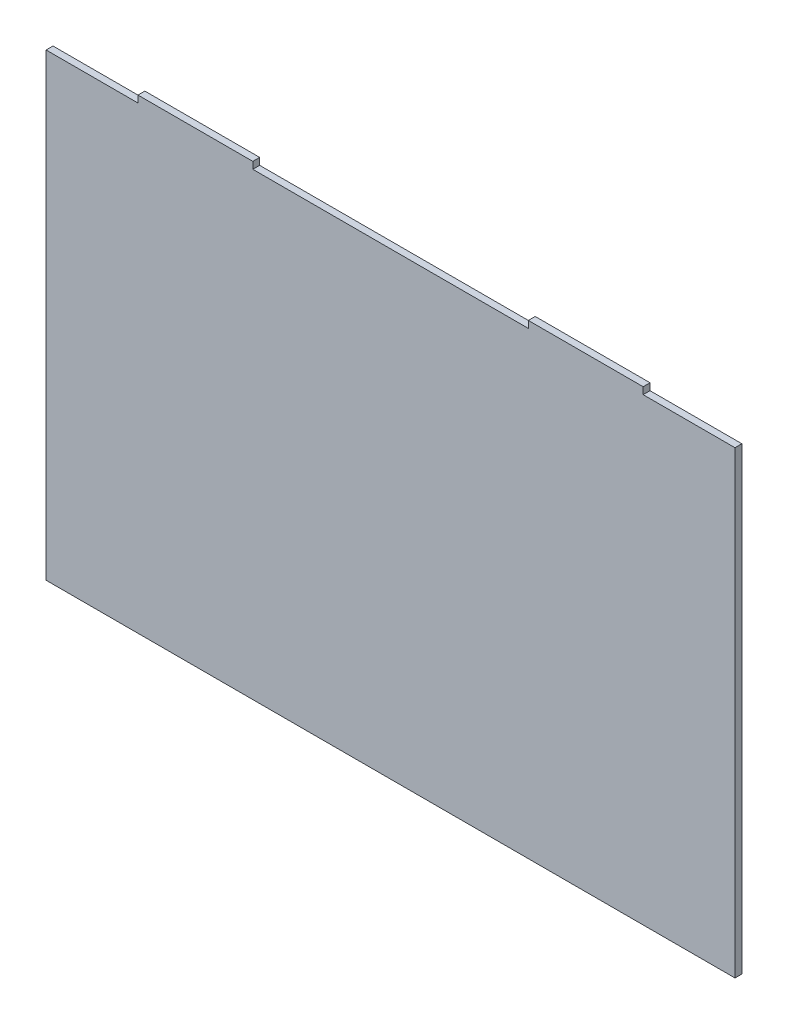
ISO-10303-21;
HEADER;
FILE_DESCRIPTION(('STEP AP214'),'2;1');
FILE_NAME('part.step','',(''),(''),'','','');
FILE_SCHEMA(('AUTOMOTIVE_DESIGN { 1 0 10303 214 1 1 1 1 }'));
ENDSEC;
DATA;
#1=APPLICATION_CONTEXT('core data for automotive mechanical design processes');
#2=APPLICATION_PROTOCOL_DEFINITION('international standard','automotive_design',2000,#1);
#3=PRODUCT_CONTEXT('',#1,'mechanical');
#4=PRODUCT('Part','Part','',(#3));
#5=PRODUCT_RELATED_PRODUCT_CATEGORY('part','',(#4));
#6=PRODUCT_DEFINITION_FORMATION('','',#4);
#7=PRODUCT_DEFINITION_CONTEXT('part definition',#1,'design');
#8=PRODUCT_DEFINITION('design','',#6,#7);
#9=PRODUCT_DEFINITION_SHAPE('','',#8);
#10=(LENGTH_UNIT() NAMED_UNIT(*) SI_UNIT(.MILLI.,.METRE.));
#11=(NAMED_UNIT(*) PLANE_ANGLE_UNIT() SI_UNIT($,.RADIAN.));
#12=(NAMED_UNIT(*) SI_UNIT($,.STERADIAN.) SOLID_ANGLE_UNIT());
#13=UNCERTAINTY_MEASURE_WITH_UNIT(LENGTH_MEASURE(1.E-05),#10,'distance_accuracy_value','');
#14=(GEOMETRIC_REPRESENTATION_CONTEXT(3) GLOBAL_UNCERTAINTY_ASSIGNED_CONTEXT((#13)) GLOBAL_UNIT_ASSIGNED_CONTEXT((#10,
#11,#12)) REPRESENTATION_CONTEXT('',''));
#15=CARTESIAN_POINT('',(0.,0.,0.));
#16=DIRECTION('',(0.,0.,1.));
#17=DIRECTION('',(1.,0.,0.));
#18=AXIS2_PLACEMENT_3D('',#15,#16,#17);
#19=CARTESIAN_POINT('',(150.,101.5,3.));
#20=DIRECTION('',(0.,-1.,0.));
#21=DIRECTION('',(1.,0.,0.));
#22=AXIS2_PLACEMENT_3D('',#19,#20,#21);
#23=PLANE('',#22);
#24=DIRECTION('',(-1.,0.,0.));
#25=VECTOR('',#24,1.);
#26=CARTESIAN_POINT('',(150.,101.5,3.));
#27=LINE('',#26,#25);
#28=CARTESIAN_POINT('',(-59.9999999999999,101.5,3.));
#29=VERTEX_POINT('',#28);
#30=CARTESIAN_POINT('',(-110.,101.5,3.));
#31=VERTEX_POINT('',#30);
#32=EDGE_CURVE('E200',#29,#31,#27,.T.);
#33=ORIENTED_EDGE('',*,*,#32,.F.);
#34=DIRECTION('',(0.,0.,1.));
#35=VECTOR('',#34,1.);
#36=CARTESIAN_POINT('',(-59.9999999999999,101.5,0.));
#37=LINE('',#36,#35);
#38=CARTESIAN_POINT('',(-59.9999999999999,101.5,0.));
#39=VERTEX_POINT('',#38);
#40=EDGE_CURVE('E152',#39,#29,#37,.T.);
#41=ORIENTED_EDGE('',*,*,#40,.F.);
#42=DIRECTION('',(-1.,0.,0.));
#43=VECTOR('',#42,1.);
#44=CARTESIAN_POINT('',(150.,101.5,0.));
#45=LINE('',#44,#43);
#46=CARTESIAN_POINT('',(-110.,101.5,0.));
#47=VERTEX_POINT('',#46);
#48=EDGE_CURVE('E142',#39,#47,#45,.T.);
#49=ORIENTED_EDGE('',*,*,#48,.T.);
#50=DIRECTION('',(0.,0.,1.));
#51=VECTOR('',#50,1.);
#52=CARTESIAN_POINT('',(-110.,101.5,0.));
#53=LINE('',#52,#51);
#54=EDGE_CURVE('E185',#47,#31,#53,.T.);
#55=ORIENTED_EDGE('',*,*,#54,.T.);
#56=EDGE_LOOP('',(#33,#41,#49,#55));
#57=FACE_BOUND('',#56,.T.);
#58=ADVANCED_FACE('F33',(#57),#23,.F.);
#59=CARTESIAN_POINT('',(-150.,-101.5,3.));
#60=DIRECTION('',(1.,0.,0.));
#61=DIRECTION('',(0.,0.,-1.));
#62=AXIS2_PLACEMENT_3D('',#59,#60,#61);
#63=PLANE('',#62);
#64=DIRECTION('',(0.,-1.,0.));
#65=VECTOR('',#64,1.);
#66=CARTESIAN_POINT('',(-150.,-101.5,3.));
#67=LINE('',#66,#65);
#68=CARTESIAN_POINT('',(-150.,98.5,3.));
#69=VERTEX_POINT('',#68);
#70=CARTESIAN_POINT('',(-150.,-101.5,3.));
#71=VERTEX_POINT('',#70);
#72=EDGE_CURVE('E192',#69,#71,#67,.T.);
#73=ORIENTED_EDGE('',*,*,#72,.F.);
#74=DIRECTION('',(0.,0.,1.));
#75=VECTOR('',#74,1.);
#76=CARTESIAN_POINT('',(-150.,98.5,0.));
#77=LINE('',#76,#75);
#78=CARTESIAN_POINT('',(-150.,98.5,0.));
#79=VERTEX_POINT('',#78);
#80=EDGE_CURVE('E180',#79,#69,#77,.T.);
#81=ORIENTED_EDGE('',*,*,#80,.F.);
#82=DIRECTION('',(0.,-1.,0.));
#83=VECTOR('',#82,1.);
#84=CARTESIAN_POINT('',(-150.,-101.5,0.));
#85=LINE('',#84,#83);
#86=CARTESIAN_POINT('',(-150.,-101.5,0.));
#87=VERTEX_POINT('',#86);
#88=EDGE_CURVE('E188',#79,#87,#85,.T.);
#89=ORIENTED_EDGE('',*,*,#88,.T.);
#90=DIRECTION('',(0.,0.,-1.));
#91=VECTOR('',#90,1.);
#92=CARTESIAN_POINT('',(-150.,-101.5,3.));
#93=LINE('',#92,#91);
#94=EDGE_CURVE('E11',#71,#87,#93,.T.);
#95=ORIENTED_EDGE('',*,*,#94,.F.);
#96=EDGE_LOOP('',(#73,#81,#89,#95));
#97=FACE_BOUND('',#96,.T.);
#98=ADVANCED_FACE('F35',(#97),#63,.F.);
#99=CARTESIAN_POINT('',(150.,-101.5,3.));
#100=DIRECTION('',(0.,1.,0.));
#101=DIRECTION('',(-1.,0.,0.));
#102=AXIS2_PLACEMENT_3D('',#99,#100,#101);
#103=PLANE('',#102);
#104=DIRECTION('',(1.,0.,0.));
#105=VECTOR('',#104,1.);
#106=CARTESIAN_POINT('',(150.,-101.5,0.));
#107=LINE('',#106,#105);
#108=CARTESIAN_POINT('',(150.,-101.5,0.));
#109=VERTEX_POINT('',#108);
#110=EDGE_CURVE('E204',#87,#109,#107,.T.);
#111=ORIENTED_EDGE('',*,*,#110,.T.);
#112=DIRECTION('',(0.,0.,-1.));
#113=VECTOR('',#112,1.);
#114=CARTESIAN_POINT('',(150.,-101.5,3.));
#115=LINE('',#114,#113);
#116=CARTESIAN_POINT('',(150.,-101.5,3.));
#117=VERTEX_POINT('',#116);
#118=EDGE_CURVE('E41',#117,#109,#115,.T.);
#119=ORIENTED_EDGE('',*,*,#118,.F.);
#120=DIRECTION('',(1.,0.,0.));
#121=VECTOR('',#120,1.);
#122=CARTESIAN_POINT('',(150.,-101.5,3.));
#123=LINE('',#122,#121);
#124=EDGE_CURVE('E194',#71,#117,#123,.T.);
#125=ORIENTED_EDGE('',*,*,#124,.F.);
#126=ORIENTED_EDGE('',*,*,#94,.T.);
#127=EDGE_LOOP('',(#111,#119,#125,#126));
#128=FACE_BOUND('',#127,.T.);
#129=ADVANCED_FACE('F236',(#128),#103,.F.);
#130=CARTESIAN_POINT('',(150.,-101.5,3.));
#131=DIRECTION('',(-1.,0.,0.));
#132=DIRECTION('',(0.,0.,1.));
#133=AXIS2_PLACEMENT_3D('',#130,#131,#132);
#134=PLANE('',#133);
#135=DIRECTION('',(0.,1.,0.));
#136=VECTOR('',#135,1.);
#137=CARTESIAN_POINT('',(150.,-101.5,0.));
#138=LINE('',#137,#136);
#139=CARTESIAN_POINT('',(150.,98.5,0.));
#140=VERTEX_POINT('',#139);
#141=EDGE_CURVE('E206',#109,#140,#138,.T.);
#142=ORIENTED_EDGE('',*,*,#141,.T.);
#143=DIRECTION('',(0.,0.,1.));
#144=VECTOR('',#143,1.);
#145=CARTESIAN_POINT('',(150.,98.5,0.));
#146=LINE('',#145,#144);
#147=CARTESIAN_POINT('',(150.,98.5,3.));
#148=VERTEX_POINT('',#147);
#149=EDGE_CURVE('E150',#140,#148,#146,.T.);
#150=ORIENTED_EDGE('',*,*,#149,.T.);
#151=DIRECTION('',(0.,1.,0.));
#152=VECTOR('',#151,1.);
#153=CARTESIAN_POINT('',(150.,-101.5,3.));
#154=LINE('',#153,#152);
#155=EDGE_CURVE('E197',#117,#148,#154,.T.);
#156=ORIENTED_EDGE('',*,*,#155,.F.);
#157=ORIENTED_EDGE('',*,*,#118,.T.);
#158=EDGE_LOOP('',(#142,#150,#156,#157));
#159=FACE_BOUND('',#158,.T.);
#160=ADVANCED_FACE('F230',(#159),#134,.F.);
#161=CARTESIAN_POINT('',(110.,101.5,0.));
#162=VERTEX_POINT('',#161);
#163=CARTESIAN_POINT('',(60.,101.5,0.));
#164=VERTEX_POINT('',#163);
#165=EDGE_CURVE('E195',#162,#164,#45,.T.);
#166=ORIENTED_EDGE('',*,*,#165,.T.);
#167=DIRECTION('',(0.,0.,1.));
#168=VECTOR('',#167,1.);
#169=CARTESIAN_POINT('',(60.,101.5,0.));
#170=LINE('',#169,#168);
#171=CARTESIAN_POINT('',(60.,101.5,3.));
#172=VERTEX_POINT('',#171);
#173=EDGE_CURVE('E155',#164,#172,#170,.T.);
#174=ORIENTED_EDGE('',*,*,#173,.T.);
#175=CARTESIAN_POINT('',(110.,101.5,3.));
#176=VERTEX_POINT('',#175);
#177=EDGE_CURVE('E202',#176,#172,#27,.T.);
#178=ORIENTED_EDGE('',*,*,#177,.F.);
#179=DIRECTION('',(0.,0.,1.));
#180=VECTOR('',#179,1.);
#181=CARTESIAN_POINT('',(110.,101.5,0.));
#182=LINE('',#181,#180);
#183=EDGE_CURVE('E164',#162,#176,#182,.T.);
#184=ORIENTED_EDGE('',*,*,#183,.F.);
#185=EDGE_LOOP('',(#166,#174,#178,#184));
#186=FACE_BOUND('',#185,.T.);
#187=ADVANCED_FACE('F224',(#186),#23,.F.);
#188=CARTESIAN_POINT('',(0.,0.,3.));
#189=DIRECTION('',(0.,0.,1.));
#190=DIRECTION('',(1.,0.,0.));
#191=AXIS2_PLACEMENT_3D('',#188,#189,#190);
#192=PLANE('',#191);
#193=DIRECTION('',(0.,-1.,0.));
#194=VECTOR('',#193,1.);
#195=CARTESIAN_POINT('',(-59.9999999999999,101.5,3.));
#196=LINE('',#195,#194);
#197=CARTESIAN_POINT('',(-59.9999999999999,98.5,3.));
#198=VERTEX_POINT('',#197);
#199=EDGE_CURVE('E128',#29,#198,#196,.T.);
#200=ORIENTED_EDGE('',*,*,#199,.F.);
#201=ORIENTED_EDGE('',*,*,#32,.T.);
#202=DIRECTION('',(0.,1.,0.));
#203=VECTOR('',#202,1.);
#204=CARTESIAN_POINT('',(-110.,101.5,3.));
#205=LINE('',#204,#203);
#206=CARTESIAN_POINT('',(-110.,98.5,3.));
#207=VERTEX_POINT('',#206);
#208=EDGE_CURVE('E178',#207,#31,#205,.T.);
#209=ORIENTED_EDGE('',*,*,#208,.F.);
#210=DIRECTION('',(1.,0.,0.));
#211=VECTOR('',#210,1.);
#212=CARTESIAN_POINT('',(-150.,98.5,3.));
#213=LINE('',#212,#211);
#214=EDGE_CURVE('E154',#69,#207,#213,.T.);
#215=ORIENTED_EDGE('',*,*,#214,.F.);
#216=ORIENTED_EDGE('',*,*,#72,.T.);
#217=ORIENTED_EDGE('',*,*,#124,.T.);
#218=ORIENTED_EDGE('',*,*,#155,.T.);
#219=DIRECTION('',(1.,0.,0.));
#220=VECTOR('',#219,1.);
#221=CARTESIAN_POINT('',(150.,98.5,3.));
#222=LINE('',#221,#220);
#223=CARTESIAN_POINT('',(110.,98.5,3.));
#224=VERTEX_POINT('',#223);
#225=EDGE_CURVE('E162',#224,#148,#222,.T.);
#226=ORIENTED_EDGE('',*,*,#225,.F.);
#227=DIRECTION('',(0.,-1.,0.));
#228=VECTOR('',#227,1.);
#229=CARTESIAN_POINT('',(110.,101.5,3.));
#230=LINE('',#229,#228);
#231=EDGE_CURVE('E165',#176,#224,#230,.T.);
#232=ORIENTED_EDGE('',*,*,#231,.F.);
#233=ORIENTED_EDGE('',*,*,#177,.T.);
#234=DIRECTION('',(0.,1.,0.));
#235=VECTOR('',#234,1.);
#236=CARTESIAN_POINT('',(60.,101.5,3.));
#237=LINE('',#236,#235);
#238=CARTESIAN_POINT('',(60.,98.5,3.));
#239=VERTEX_POINT('',#238);
#240=EDGE_CURVE('E143',#239,#172,#237,.T.);
#241=ORIENTED_EDGE('',*,*,#240,.F.);
#242=DIRECTION('',(1.,0.,0.));
#243=VECTOR('',#242,1.);
#244=CARTESIAN_POINT('',(-59.9999999999999,98.5,3.));
#245=LINE('',#244,#243);
#246=EDGE_CURVE('E145',#198,#239,#245,.T.);
#247=ORIENTED_EDGE('',*,*,#246,.F.);
#248=EDGE_LOOP('',(#200,#201,#209,#215,#216,#217,#218,#226,#232,#233,#241,#247));
#249=FACE_BOUND('',#248,.T.);
#250=ADVANCED_FACE('F219',(#249),#192,.T.);
#251=CARTESIAN_POINT('',(0.,0.,0.));
#252=DIRECTION('',(0.,0.,1.));
#253=DIRECTION('',(1.,0.,0.));
#254=AXIS2_PLACEMENT_3D('',#251,#252,#253);
#255=PLANE('',#254);
#256=ORIENTED_EDGE('',*,*,#48,.F.);
#257=DIRECTION('',(0.,-1.,0.));
#258=VECTOR('',#257,1.);
#259=CARTESIAN_POINT('',(-59.9999999999999,101.5,0.));
#260=LINE('',#259,#258);
#261=CARTESIAN_POINT('',(-59.9999999999999,98.5,0.));
#262=VERTEX_POINT('',#261);
#263=EDGE_CURVE('E125',#39,#262,#260,.T.);
#264=ORIENTED_EDGE('',*,*,#263,.T.);
#265=DIRECTION('',(1.,0.,0.));
#266=VECTOR('',#265,1.);
#267=CARTESIAN_POINT('',(-59.9999999999999,98.5,0.));
#268=LINE('',#267,#266);
#269=CARTESIAN_POINT('',(60.,98.5,0.));
#270=VERTEX_POINT('',#269);
#271=EDGE_CURVE('E135',#262,#270,#268,.T.);
#272=ORIENTED_EDGE('',*,*,#271,.T.);
#273=DIRECTION('',(0.,1.,0.));
#274=VECTOR('',#273,1.);
#275=CARTESIAN_POINT('',(60.,101.5,0.));
#276=LINE('',#275,#274);
#277=EDGE_CURVE('E48',#270,#164,#276,.T.);
#278=ORIENTED_EDGE('',*,*,#277,.T.);
#279=ORIENTED_EDGE('',*,*,#165,.F.);
#280=DIRECTION('',(0.,-1.,0.));
#281=VECTOR('',#280,1.);
#282=CARTESIAN_POINT('',(110.,101.5,0.));
#283=LINE('',#282,#281);
#284=CARTESIAN_POINT('',(110.,98.5,0.));
#285=VERTEX_POINT('',#284);
#286=EDGE_CURVE('E159',#162,#285,#283,.T.);
#287=ORIENTED_EDGE('',*,*,#286,.T.);
#288=DIRECTION('',(1.,0.,0.));
#289=VECTOR('',#288,1.);
#290=CARTESIAN_POINT('',(150.,98.5,0.));
#291=LINE('',#290,#289);
#292=EDGE_CURVE('E56',#285,#140,#291,.T.);
#293=ORIENTED_EDGE('',*,*,#292,.T.);
#294=ORIENTED_EDGE('',*,*,#141,.F.);
#295=ORIENTED_EDGE('',*,*,#110,.F.);
#296=ORIENTED_EDGE('',*,*,#88,.F.);
#297=DIRECTION('',(1.,0.,0.));
#298=VECTOR('',#297,1.);
#299=CARTESIAN_POINT('',(-150.,98.5,0.));
#300=LINE('',#299,#298);
#301=CARTESIAN_POINT('',(-110.,98.5,0.));
#302=VERTEX_POINT('',#301);
#303=EDGE_CURVE('E174',#79,#302,#300,.T.);
#304=ORIENTED_EDGE('',*,*,#303,.T.);
#305=DIRECTION('',(0.,1.,0.));
#306=VECTOR('',#305,1.);
#307=CARTESIAN_POINT('',(-110.,101.5,0.));
#308=LINE('',#307,#306);
#309=EDGE_CURVE('E177',#302,#47,#308,.T.);
#310=ORIENTED_EDGE('',*,*,#309,.T.);
#311=EDGE_LOOP('',(#256,#264,#272,#278,#279,#287,#293,#294,#295,#296,#304,#310));
#312=FACE_BOUND('',#311,.T.);
#313=ADVANCED_FACE('F140',(#312),#255,.F.);
#314=CARTESIAN_POINT('',(-110.,101.5,0.));
#315=DIRECTION('',(1.,0.,0.));
#316=DIRECTION('',(0.,0.,-1.));
#317=AXIS2_PLACEMENT_3D('',#314,#315,#316);
#318=PLANE('',#317);
#319=ORIENTED_EDGE('',*,*,#208,.T.);
#320=ORIENTED_EDGE('',*,*,#54,.F.);
#321=ORIENTED_EDGE('',*,*,#309,.F.);
#322=DIRECTION('',(0.,0.,1.));
#323=VECTOR('',#322,1.);
#324=CARTESIAN_POINT('',(-110.,98.5,0.));
#325=LINE('',#324,#323);
#326=EDGE_CURVE('E189',#302,#207,#325,.T.);
#327=ORIENTED_EDGE('',*,*,#326,.T.);
#328=EDGE_LOOP('',(#319,#320,#321,#327));
#329=FACE_BOUND('',#328,.T.);
#330=ADVANCED_FACE('F248',(#329),#318,.F.);
#331=CARTESIAN_POINT('',(-150.,98.5,0.));
#332=DIRECTION('',(0.,-1.,0.));
#333=DIRECTION('',(0.,0.,-1.));
#334=AXIS2_PLACEMENT_3D('',#331,#332,#333);
#335=PLANE('',#334);
#336=ORIENTED_EDGE('',*,*,#214,.T.);
#337=ORIENTED_EDGE('',*,*,#326,.F.);
#338=ORIENTED_EDGE('',*,*,#303,.F.);
#339=ORIENTED_EDGE('',*,*,#80,.T.);
#340=EDGE_LOOP('',(#336,#337,#338,#339));
#341=FACE_BOUND('',#340,.T.);
#342=ADVANCED_FACE('F242',(#341),#335,.F.);
#343=CARTESIAN_POINT('',(150.,98.5,0.));
#344=DIRECTION('',(0.,-1.,0.));
#345=DIRECTION('',(0.,0.,-1.));
#346=AXIS2_PLACEMENT_3D('',#343,#344,#345);
#347=PLANE('',#346);
#348=ORIENTED_EDGE('',*,*,#225,.T.);
#349=ORIENTED_EDGE('',*,*,#149,.F.);
#350=ORIENTED_EDGE('',*,*,#292,.F.);
#351=DIRECTION('',(0.,0.,1.));
#352=VECTOR('',#351,1.);
#353=CARTESIAN_POINT('',(110.,98.5,0.));
#354=LINE('',#353,#352);
#355=EDGE_CURVE('E171',#285,#224,#354,.T.);
#356=ORIENTED_EDGE('',*,*,#355,.T.);
#357=EDGE_LOOP('',(#348,#349,#350,#356));
#358=FACE_BOUND('',#357,.T.);
#359=ADVANCED_FACE('F229',(#358),#347,.F.);
#360=CARTESIAN_POINT('',(110.,101.5,0.));
#361=DIRECTION('',(-1.,0.,0.));
#362=DIRECTION('',(0.,0.,1.));
#363=AXIS2_PLACEMENT_3D('',#360,#361,#362);
#364=PLANE('',#363);
#365=ORIENTED_EDGE('',*,*,#231,.T.);
#366=ORIENTED_EDGE('',*,*,#355,.F.);
#367=ORIENTED_EDGE('',*,*,#286,.F.);
#368=ORIENTED_EDGE('',*,*,#183,.T.);
#369=EDGE_LOOP('',(#365,#366,#367,#368));
#370=FACE_BOUND('',#369,.T.);
#371=ADVANCED_FACE('F228',(#370),#364,.F.);
#372=CARTESIAN_POINT('',(-59.9999999999999,101.5,0.));
#373=DIRECTION('',(-1.,0.,0.));
#374=DIRECTION('',(0.,0.,1.));
#375=AXIS2_PLACEMENT_3D('',#372,#373,#374);
#376=PLANE('',#375);
#377=ORIENTED_EDGE('',*,*,#199,.T.);
#378=DIRECTION('',(0.,0.,1.));
#379=VECTOR('',#378,1.);
#380=CARTESIAN_POINT('',(-59.9999999999999,98.5,0.));
#381=LINE('',#380,#379);
#382=EDGE_CURVE('E121',#262,#198,#381,.T.);
#383=ORIENTED_EDGE('',*,*,#382,.F.);
#384=ORIENTED_EDGE('',*,*,#263,.F.);
#385=ORIENTED_EDGE('',*,*,#40,.T.);
#386=EDGE_LOOP('',(#377,#383,#384,#385));
#387=FACE_BOUND('',#386,.T.);
#388=ADVANCED_FACE('F123',(#387),#376,.F.);
#389=CARTESIAN_POINT('',(60.,101.5,0.));
#390=DIRECTION('',(1.,0.,0.));
#391=DIRECTION('',(0.,0.,-1.));
#392=AXIS2_PLACEMENT_3D('',#389,#390,#391);
#393=PLANE('',#392);
#394=ORIENTED_EDGE('',*,*,#240,.T.);
#395=ORIENTED_EDGE('',*,*,#173,.F.);
#396=ORIENTED_EDGE('',*,*,#277,.F.);
#397=DIRECTION('',(0.,0.,1.));
#398=VECTOR('',#397,1.);
#399=CARTESIAN_POINT('',(60.,98.5,0.));
#400=LINE('',#399,#398);
#401=EDGE_CURVE('E132',#270,#239,#400,.T.);
#402=ORIENTED_EDGE('',*,*,#401,.T.);
#403=EDGE_LOOP('',(#394,#395,#396,#402));
#404=FACE_BOUND('',#403,.T.);
#405=ADVANCED_FACE('F226',(#404),#393,.F.);
#406=CARTESIAN_POINT('',(-59.9999999999999,98.5,0.));
#407=DIRECTION('',(0.,-1.,0.));
#408=DIRECTION('',(0.,0.,-1.));
#409=AXIS2_PLACEMENT_3D('',#406,#407,#408);
#410=PLANE('',#409);
#411=ORIENTED_EDGE('',*,*,#246,.T.);
#412=ORIENTED_EDGE('',*,*,#401,.F.);
#413=ORIENTED_EDGE('',*,*,#271,.F.);
#414=ORIENTED_EDGE('',*,*,#382,.T.);
#415=EDGE_LOOP('',(#411,#412,#413,#414));
#416=FACE_BOUND('',#415,.T.);
#417=ADVANCED_FACE('F136',(#416),#410,.F.);
#418=CLOSED_SHELL('',(#58,#98,#129,#160,#187,#250,#313,#330,#342,#359,#371,#388,#405,#417));
#419=MANIFOLD_SOLID_BREP('B2',#418);
#420=ADVANCED_BREP_SHAPE_REPRESENTATION('',(#18,#419),#14);
#421=SHAPE_DEFINITION_REPRESENTATION(#9,#420);
ENDSEC;
END-ISO-10303-21;
